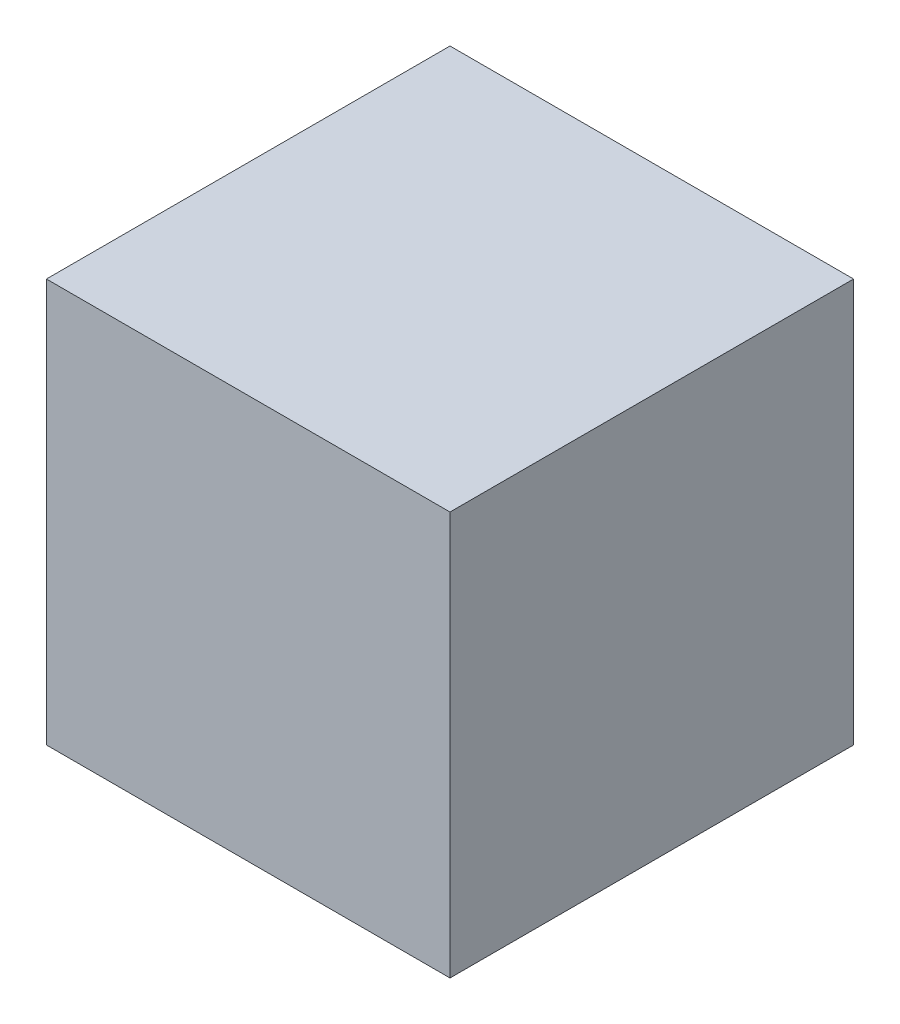
ISO-10303-21;
HEADER;
FILE_DESCRIPTION(('STEP AP214'),'2;1');
FILE_NAME('part.step','',(''),(''),'','','');
FILE_SCHEMA(('AUTOMOTIVE_DESIGN { 1 0 10303 214 1 1 1 1 }'));
ENDSEC;
DATA;
#1=APPLICATION_CONTEXT('core data for automotive mechanical design processes');
#2=APPLICATION_PROTOCOL_DEFINITION('international standard','automotive_design',2000,#1);
#3=PRODUCT_CONTEXT('',#1,'mechanical');
#4=PRODUCT('Part','Part','',(#3));
#5=PRODUCT_RELATED_PRODUCT_CATEGORY('part','',(#4));
#6=PRODUCT_DEFINITION_FORMATION('','',#4);
#7=PRODUCT_DEFINITION_CONTEXT('part definition',#1,'design');
#8=PRODUCT_DEFINITION('design','',#6,#7);
#9=PRODUCT_DEFINITION_SHAPE('','',#8);
#10=(LENGTH_UNIT() NAMED_UNIT(*) SI_UNIT(.MILLI.,.METRE.));
#11=(NAMED_UNIT(*) PLANE_ANGLE_UNIT() SI_UNIT($,.RADIAN.));
#12=(NAMED_UNIT(*) SI_UNIT($,.STERADIAN.) SOLID_ANGLE_UNIT());
#13=UNCERTAINTY_MEASURE_WITH_UNIT(LENGTH_MEASURE(1.E-05),#10,'distance_accuracy_value','');
#14=(GEOMETRIC_REPRESENTATION_CONTEXT(3) GLOBAL_UNCERTAINTY_ASSIGNED_CONTEXT((#13)) GLOBAL_UNIT_ASSIGNED_CONTEXT((#10,
#11,#12)) REPRESENTATION_CONTEXT('',''));
#15=CARTESIAN_POINT('',(0.,0.,0.));
#16=DIRECTION('',(0.,0.,1.));
#17=DIRECTION('',(1.,0.,0.));
#18=AXIS2_PLACEMENT_3D('',#15,#16,#17);
#19=CARTESIAN_POINT('',(0.,100.,100.));
#20=DIRECTION('',(0.,0.,-1.));
#21=DIRECTION('',(-1.,0.,0.));
#22=AXIS2_PLACEMENT_3D('',#19,#20,#21);
#23=PLANE('',#22);
#24=DIRECTION('',(1.,0.,0.));
#25=VECTOR('',#24,1.);
#26=CARTESIAN_POINT('',(0.,0.,100.));
#27=LINE('',#26,#25);
#28=CARTESIAN_POINT('',(0.,0.,100.));
#29=VERTEX_POINT('',#28);
#30=CARTESIAN_POINT('',(100.,0.,100.));
#31=VERTEX_POINT('',#30);
#32=EDGE_CURVE('E106',#29,#31,#27,.T.);
#33=ORIENTED_EDGE('',*,*,#32,.T.);
#34=DIRECTION('',(0.,-1.,0.));
#35=VECTOR('',#34,1.);
#36=CARTESIAN_POINT('',(100.,100.,100.));
#37=LINE('',#36,#35);
#38=CARTESIAN_POINT('',(100.,100.,100.));
#39=VERTEX_POINT('',#38);
#40=EDGE_CURVE('E11',#39,#31,#37,.T.);
#41=ORIENTED_EDGE('',*,*,#40,.F.);
#42=DIRECTION('',(1.,0.,0.));
#43=VECTOR('',#42,1.);
#44=CARTESIAN_POINT('',(0.,100.,100.));
#45=LINE('',#44,#43);
#46=CARTESIAN_POINT('',(0.,100.,100.));
#47=VERTEX_POINT('',#46);
#48=EDGE_CURVE('E79',#47,#39,#45,.T.);
#49=ORIENTED_EDGE('',*,*,#48,.F.);
#50=DIRECTION('',(0.,-1.,0.));
#51=VECTOR('',#50,1.);
#52=CARTESIAN_POINT('',(0.,100.,100.));
#53=LINE('',#52,#51);
#54=EDGE_CURVE('E102',#47,#29,#53,.T.);
#55=ORIENTED_EDGE('',*,*,#54,.T.);
#56=EDGE_LOOP('',(#33,#41,#49,#55));
#57=FACE_BOUND('',#56,.T.);
#58=ADVANCED_FACE('F39',(#57),#23,.F.);
#59=CARTESIAN_POINT('',(100.,100.,0.));
#60=DIRECTION('',(1.,0.,0.));
#61=DIRECTION('',(0.,0.,-1.));
#62=AXIS2_PLACEMENT_3D('',#59,#60,#61);
#63=PLANE('',#62);
#64=DIRECTION('',(0.,0.,1.));
#65=VECTOR('',#64,1.);
#66=CARTESIAN_POINT('',(100.,0.,0.));
#67=LINE('',#66,#65);
#68=CARTESIAN_POINT('',(100.,0.,0.));
#69=VERTEX_POINT('',#68);
#70=EDGE_CURVE('E88',#69,#31,#67,.T.);
#71=ORIENTED_EDGE('',*,*,#70,.F.);
#72=DIRECTION('',(0.,-1.,0.));
#73=VECTOR('',#72,1.);
#74=CARTESIAN_POINT('',(100.,100.,0.));
#75=LINE('',#74,#73);
#76=CARTESIAN_POINT('',(100.,100.,0.));
#77=VERTEX_POINT('',#76);
#78=EDGE_CURVE('E48',#77,#69,#75,.T.);
#79=ORIENTED_EDGE('',*,*,#78,.F.);
#80=DIRECTION('',(0.,0.,1.));
#81=VECTOR('',#80,1.);
#82=CARTESIAN_POINT('',(100.,100.,0.));
#83=LINE('',#82,#81);
#84=EDGE_CURVE('E86',#77,#39,#83,.T.);
#85=ORIENTED_EDGE('',*,*,#84,.T.);
#86=ORIENTED_EDGE('',*,*,#40,.T.);
#87=EDGE_LOOP('',(#71,#79,#85,#86));
#88=FACE_BOUND('',#87,.T.);
#89=ADVANCED_FACE('F85',(#88),#63,.T.);
#90=CARTESIAN_POINT('',(0.,100.,0.));
#91=DIRECTION('',(0.,0.,-1.));
#92=DIRECTION('',(-1.,0.,0.));
#93=AXIS2_PLACEMENT_3D('',#90,#91,#92);
#94=PLANE('',#93);
#95=DIRECTION('',(1.,0.,0.));
#96=VECTOR('',#95,1.);
#97=CARTESIAN_POINT('',(0.,0.,0.));
#98=LINE('',#97,#96);
#99=CARTESIAN_POINT('',(0.,0.,0.));
#100=VERTEX_POINT('',#99);
#101=EDGE_CURVE('E112',#100,#69,#98,.T.);
#102=ORIENTED_EDGE('',*,*,#101,.F.);
#103=DIRECTION('',(0.,-1.,0.));
#104=VECTOR('',#103,1.);
#105=CARTESIAN_POINT('',(0.,100.,0.));
#106=LINE('',#105,#104);
#107=CARTESIAN_POINT('',(0.,100.,0.));
#108=VERTEX_POINT('',#107);
#109=EDGE_CURVE('E71',#108,#100,#106,.T.);
#110=ORIENTED_EDGE('',*,*,#109,.F.);
#111=DIRECTION('',(1.,0.,0.));
#112=VECTOR('',#111,1.);
#113=CARTESIAN_POINT('',(0.,100.,0.));
#114=LINE('',#113,#112);
#115=EDGE_CURVE('E95',#108,#77,#114,.T.);
#116=ORIENTED_EDGE('',*,*,#115,.T.);
#117=ORIENTED_EDGE('',*,*,#78,.T.);
#118=EDGE_LOOP('',(#102,#110,#116,#117));
#119=FACE_BOUND('',#118,.T.);
#120=ADVANCED_FACE('F98',(#119),#94,.T.);
#121=CARTESIAN_POINT('',(0.,100.,0.));
#122=DIRECTION('',(1.,0.,0.));
#123=DIRECTION('',(0.,0.,-1.));
#124=AXIS2_PLACEMENT_3D('',#121,#122,#123);
#125=PLANE('',#124);
#126=DIRECTION('',(0.,0.,1.));
#127=VECTOR('',#126,1.);
#128=CARTESIAN_POINT('',(0.,0.,0.));
#129=LINE('',#128,#127);
#130=EDGE_CURVE('E74',#100,#29,#129,.T.);
#131=ORIENTED_EDGE('',*,*,#130,.T.);
#132=ORIENTED_EDGE('',*,*,#54,.F.);
#133=DIRECTION('',(0.,0.,1.));
#134=VECTOR('',#133,1.);
#135=CARTESIAN_POINT('',(0.,100.,0.));
#136=LINE('',#135,#134);
#137=EDGE_CURVE('E56',#108,#47,#136,.T.);
#138=ORIENTED_EDGE('',*,*,#137,.F.);
#139=ORIENTED_EDGE('',*,*,#109,.T.);
#140=EDGE_LOOP('',(#131,#132,#138,#139));
#141=FACE_BOUND('',#140,.T.);
#142=ADVANCED_FACE('F129',(#141),#125,.F.);
#143=CARTESIAN_POINT('',(0.,100.,0.));
#144=DIRECTION('',(0.,-1.,0.));
#145=DIRECTION('',(0.,0.,-1.));
#146=AXIS2_PLACEMENT_3D('',#143,#144,#145);
#147=PLANE('',#146);
#148=ORIENTED_EDGE('',*,*,#48,.T.);
#149=ORIENTED_EDGE('',*,*,#84,.F.);
#150=ORIENTED_EDGE('',*,*,#115,.F.);
#151=ORIENTED_EDGE('',*,*,#137,.T.);
#152=EDGE_LOOP('',(#148,#149,#150,#151));
#153=FACE_BOUND('',#152,.T.);
#154=ADVANCED_FACE('F94',(#153),#147,.F.);
#155=CARTESIAN_POINT('',(0.,0.,0.));
#156=DIRECTION('',(0.,-1.,0.));
#157=DIRECTION('',(0.,0.,-1.));
#158=AXIS2_PLACEMENT_3D('',#155,#156,#157);
#159=PLANE('',#158);
#160=ORIENTED_EDGE('',*,*,#32,.F.);
#161=ORIENTED_EDGE('',*,*,#130,.F.);
#162=ORIENTED_EDGE('',*,*,#101,.T.);
#163=ORIENTED_EDGE('',*,*,#70,.T.);
#164=EDGE_LOOP('',(#160,#161,#162,#163));
#165=FACE_BOUND('',#164,.T.);
#166=ADVANCED_FACE('F123',(#165),#159,.T.);
#167=CLOSED_SHELL('',(#58,#89,#120,#142,#154,#166));
#168=MANIFOLD_SOLID_BREP('B2',#167);
#169=ADVANCED_BREP_SHAPE_REPRESENTATION('',(#18,#168),#14);
#170=SHAPE_DEFINITION_REPRESENTATION(#9,#169);
ENDSEC;
END-ISO-10303-21;
